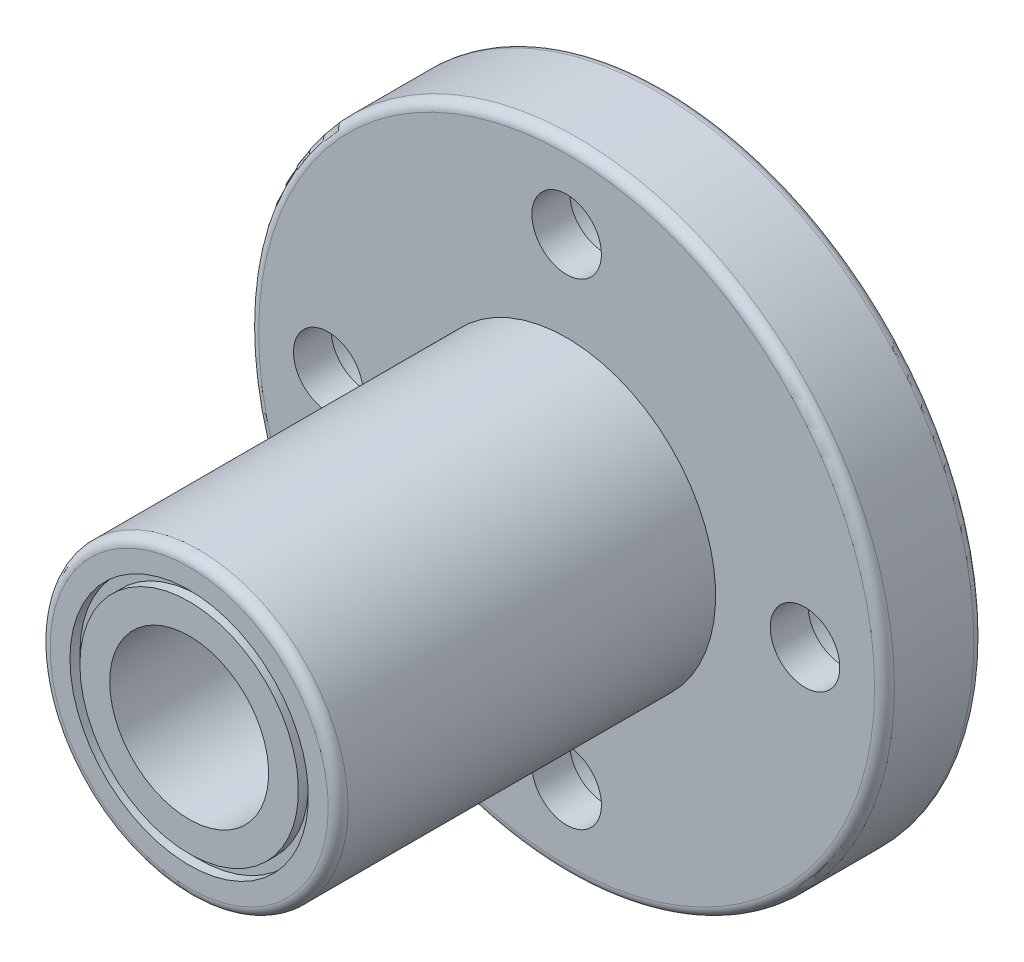
ISO-10303-21;
HEADER;
FILE_DESCRIPTION(('STEP AP214'),'2;1');
FILE_NAME('part.step','',(''),(''),'','','');
FILE_SCHEMA(('AUTOMOTIVE_DESIGN { 1 0 10303 214 1 1 1 1 }'));
ENDSEC;
DATA;
#1=APPLICATION_CONTEXT('core data for automotive mechanical design processes');
#2=APPLICATION_PROTOCOL_DEFINITION('international standard','automotive_design',2000,#1);
#3=PRODUCT_CONTEXT('',#1,'mechanical');
#4=PRODUCT('Part','Part','',(#3));
#5=PRODUCT_RELATED_PRODUCT_CATEGORY('part','',(#4));
#6=PRODUCT_DEFINITION_FORMATION('','',#4);
#7=PRODUCT_DEFINITION_CONTEXT('part definition',#1,'design');
#8=PRODUCT_DEFINITION('design','',#6,#7);
#9=PRODUCT_DEFINITION_SHAPE('','',#8);
#10=(LENGTH_UNIT() NAMED_UNIT(*) SI_UNIT(.MILLI.,.METRE.));
#11=(NAMED_UNIT(*) PLANE_ANGLE_UNIT() SI_UNIT($,.RADIAN.));
#12=(NAMED_UNIT(*) SI_UNIT($,.STERADIAN.) SOLID_ANGLE_UNIT());
#13=UNCERTAINTY_MEASURE_WITH_UNIT(LENGTH_MEASURE(1.E-05),#10,'distance_accuracy_value','');
#14=(GEOMETRIC_REPRESENTATION_CONTEXT(3) GLOBAL_UNCERTAINTY_ASSIGNED_CONTEXT((#13)) GLOBAL_UNIT_ASSIGNED_CONTEXT((#10,
#11,#12)) REPRESENTATION_CONTEXT('',''));
#15=CARTESIAN_POINT('',(0.,0.,0.));
#16=DIRECTION('',(0.,0.,1.));
#17=DIRECTION('',(1.,0.,0.));
#18=AXIS2_PLACEMENT_3D('',#15,#16,#17);
#19=CARTESIAN_POINT('',(0.,7.5,0.));
#20=DIRECTION('',(0.,0.,-1.));
#21=DIRECTION('',(-1.,0.,0.));
#22=AXIS2_PLACEMENT_3D('',#19,#20,#21);
#23=PLANE('',#22);
#24=CARTESIAN_POINT('',(0.,0.,0.));
#25=DIRECTION('',(0.,0.,-1.));
#26=DIRECTION('',(-1.,0.,0.));
#27=AXIS2_PLACEMENT_3D('',#24,#25,#26);
#28=CIRCLE('',#27,15.5);
#29=CARTESIAN_POINT('',(-15.5,0.,0.));
#30=VERTEX_POINT('',#29);
#31=EDGE_CURVE('E69',#30,#30,#28,.T.);
#32=ORIENTED_EDGE('',*,*,#31,.T.);
#33=EDGE_LOOP('',(#32));
#34=FACE_BOUND('',#33,.T.);
#35=CARTESIAN_POINT('',(0.,-12.,0.));
#36=DIRECTION('',(0.,0.,1.));
#37=DIRECTION('',(0.,1.,0.));
#38=AXIS2_PLACEMENT_3D('',#35,#36,#37);
#39=CIRCLE('',#38,3.);
#40=CARTESIAN_POINT('',(0.,-9.00000000000001,0.));
#41=VERTEX_POINT('',#40);
#42=EDGE_CURVE('E164',#41,#41,#39,.T.);
#43=ORIENTED_EDGE('',*,*,#42,.T.);
#44=EDGE_LOOP('',(#43));
#45=FACE_BOUND('',#44,.T.);
#46=CARTESIAN_POINT('',(0.,12.,0.));
#47=DIRECTION('',(0.,0.,1.));
#48=DIRECTION('',(0.,-1.,0.));
#49=AXIS2_PLACEMENT_3D('',#46,#47,#48);
#50=CIRCLE('',#49,3.);
#51=CARTESIAN_POINT('',(0.,9.00000000000001,0.));
#52=VERTEX_POINT('',#51);
#53=EDGE_CURVE('E133',#52,#52,#50,.T.);
#54=ORIENTED_EDGE('',*,*,#53,.T.);
#55=EDGE_LOOP('',(#54));
#56=FACE_BOUND('',#55,.T.);
#57=CARTESIAN_POINT('',(0.,0.,0.));
#58=DIRECTION('',(0.,0.,-1.));
#59=DIRECTION('',(-1.,0.,0.));
#60=AXIS2_PLACEMENT_3D('',#57,#58,#59);
#61=CIRCLE('',#60,7.5);
#62=CARTESIAN_POINT('',(-7.5,0.,0.));
#63=VERTEX_POINT('',#62);
#64=EDGE_CURVE('E129',#63,#63,#61,.T.);
#65=ORIENTED_EDGE('',*,*,#64,.F.);
#66=EDGE_LOOP('',(#65));
#67=FACE_BOUND('',#66,.T.);
#68=CARTESIAN_POINT('',(12.,0.,0.));
#69=DIRECTION('',(0.,0.,1.));
#70=DIRECTION('',(-1.,0.,0.));
#71=AXIS2_PLACEMENT_3D('',#68,#69,#70);
#72=CIRCLE('',#71,3.);
#73=CARTESIAN_POINT('',(9.00000000000001,0.,0.));
#74=VERTEX_POINT('',#73);
#75=EDGE_CURVE('E149',#74,#74,#72,.T.);
#76=ORIENTED_EDGE('',*,*,#75,.T.);
#77=EDGE_LOOP('',(#76));
#78=FACE_BOUND('',#77,.T.);
#79=CARTESIAN_POINT('',(-12.,1.25693328198353E-13,0.));
#80=DIRECTION('',(0.,0.,1.));
#81=DIRECTION('',(1.,0.,0.));
#82=AXIS2_PLACEMENT_3D('',#79,#80,#81);
#83=CIRCLE('',#82,3.);
#84=CARTESIAN_POINT('',(-9.00000000000001,0.,0.));
#85=VERTEX_POINT('',#84);
#86=EDGE_CURVE('E180',#85,#85,#83,.T.);
#87=ORIENTED_EDGE('',*,*,#86,.T.);
#88=EDGE_LOOP('',(#87));
#89=FACE_BOUND('',#88,.T.);
#90=ADVANCED_FACE('F40',(#34,#45,#56,#67,#78,#89),#23,.T.);
#91=CARTESIAN_POINT('',(0.,16.,5.));
#92=DIRECTION('',(0.,0.,1.));
#93=DIRECTION('',(1.,0.,0.));
#94=AXIS2_PLACEMENT_3D('',#91,#92,#93);
#95=PLANE('',#94);
#96=CARTESIAN_POINT('',(0.,0.,5.));
#97=DIRECTION('',(0.,0.,1.));
#98=DIRECTION('',(1.,0.,0.));
#99=AXIS2_PLACEMENT_3D('',#96,#97,#98);
#100=CIRCLE('',#99,15.5);
#101=CARTESIAN_POINT('',(15.5,0.,5.));
#102=VERTEX_POINT('',#101);
#103=EDGE_CURVE('E54',#102,#102,#100,.T.);
#104=ORIENTED_EDGE('',*,*,#103,.T.);
#105=EDGE_LOOP('',(#104));
#106=FACE_BOUND('',#105,.T.);
#107=CARTESIAN_POINT('',(0.,-12.,5.));
#108=DIRECTION('',(0.,0.,1.));
#109=DIRECTION('',(0.,1.,0.));
#110=AXIS2_PLACEMENT_3D('',#107,#108,#109);
#111=CIRCLE('',#110,1.75);
#112=CARTESIAN_POINT('',(0.,-10.25,5.));
#113=VERTEX_POINT('',#112);
#114=EDGE_CURVE('E176',#113,#113,#111,.T.);
#115=ORIENTED_EDGE('',*,*,#114,.F.);
#116=EDGE_LOOP('',(#115));
#117=FACE_BOUND('',#116,.T.);
#118=CARTESIAN_POINT('',(0.,12.,5.));
#119=DIRECTION('',(0.,0.,1.));
#120=DIRECTION('',(0.,-1.,0.));
#121=AXIS2_PLACEMENT_3D('',#118,#119,#120);
#122=CIRCLE('',#121,1.75);
#123=CARTESIAN_POINT('',(0.,10.25,5.));
#124=VERTEX_POINT('',#123);
#125=EDGE_CURVE('E145',#124,#124,#122,.T.);
#126=ORIENTED_EDGE('',*,*,#125,.F.);
#127=EDGE_LOOP('',(#126));
#128=FACE_BOUND('',#127,.T.);
#129=CARTESIAN_POINT('',(0.,0.,5.));
#130=DIRECTION('',(0.,0.,-1.));
#131=DIRECTION('',(-1.,0.,0.));
#132=AXIS2_PLACEMENT_3D('',#129,#130,#131);
#133=CIRCLE('',#132,7.5);
#134=CARTESIAN_POINT('',(-7.5,0.,5.));
#135=VERTEX_POINT('',#134);
#136=EDGE_CURVE('E73',#135,#135,#133,.T.);
#137=ORIENTED_EDGE('',*,*,#136,.T.);
#138=EDGE_LOOP('',(#137));
#139=FACE_BOUND('',#138,.T.);
#140=CARTESIAN_POINT('',(12.,0.,5.));
#141=DIRECTION('',(0.,0.,1.));
#142=DIRECTION('',(-1.,0.,0.));
#143=AXIS2_PLACEMENT_3D('',#140,#141,#142);
#144=CIRCLE('',#143,1.75);
#145=CARTESIAN_POINT('',(10.25,0.,5.));
#146=VERTEX_POINT('',#145);
#147=EDGE_CURVE('E161',#146,#146,#144,.T.);
#148=ORIENTED_EDGE('',*,*,#147,.F.);
#149=EDGE_LOOP('',(#148));
#150=FACE_BOUND('',#149,.T.);
#151=CARTESIAN_POINT('',(-12.,1.25693328198353E-13,5.));
#152=DIRECTION('',(0.,0.,1.));
#153=DIRECTION('',(1.,0.,0.));
#154=AXIS2_PLACEMENT_3D('',#151,#152,#153);
#155=CIRCLE('',#154,1.75);
#156=CARTESIAN_POINT('',(-10.25,1.07363051169426E-13,5.));
#157=VERTEX_POINT('',#156);
#158=EDGE_CURVE('E192',#157,#157,#155,.T.);
#159=ORIENTED_EDGE('',*,*,#158,.F.);
#160=EDGE_LOOP('',(#159));
#161=FACE_BOUND('',#160,.T.);
#162=ADVANCED_FACE('F200',(#106,#117,#128,#139,#150,#161),#95,.T.);
#163=CARTESIAN_POINT('',(0.,0.,0.));
#164=DIRECTION('',(0.,0.,-1.));
#165=DIRECTION('',(-1.,0.,0.));
#166=AXIS2_PLACEMENT_3D('',#163,#164,#165);
#167=CYLINDRICAL_SURFACE('',#166,16.);
#168=CARTESIAN_POINT('',(0.,0.,0.5));
#169=DIRECTION('',(0.,0.,-1.));
#170=DIRECTION('',(-1.,0.,0.));
#171=AXIS2_PLACEMENT_3D('',#168,#169,#170);
#172=CIRCLE('',#171,16.);
#173=CARTESIAN_POINT('',(-16.,0.,0.5));
#174=VERTEX_POINT('',#173);
#175=EDGE_CURVE('E60',#174,#174,#172,.F.);
#176=ORIENTED_EDGE('',*,*,#175,.T.);
#177=EDGE_LOOP('',(#176));
#178=FACE_BOUND('',#177,.T.);
#179=CARTESIAN_POINT('',(0.,0.,4.5));
#180=DIRECTION('',(0.,0.,1.));
#181=DIRECTION('',(1.,0.,0.));
#182=AXIS2_PLACEMENT_3D('',#179,#180,#181);
#183=CIRCLE('',#182,16.);
#184=CARTESIAN_POINT('',(16.,0.,4.5));
#185=VERTEX_POINT('',#184);
#186=EDGE_CURVE('E66',#185,#185,#183,.F.);
#187=ORIENTED_EDGE('',*,*,#186,.T.);
#188=EDGE_LOOP('',(#187));
#189=FACE_BOUND('',#188,.T.);
#190=ADVANCED_FACE('F202',(#178,#189),#167,.T.);
#191=CARTESIAN_POINT('',(0.,0.,0.));
#192=DIRECTION('',(0.,0.,-1.));
#193=DIRECTION('',(-1.,0.,0.));
#194=AXIS2_PLACEMENT_3D('',#191,#192,#193);
#195=CYLINDRICAL_SURFACE('',#194,7.5);
#196=CARTESIAN_POINT('',(0.,0.,23.5));
#197=DIRECTION('',(0.,0.,1.));
#198=DIRECTION('',(1.,0.,0.));
#199=AXIS2_PLACEMENT_3D('',#196,#197,#198);
#200=CIRCLE('',#199,7.5);
#201=CARTESIAN_POINT('',(7.5,0.,23.5));
#202=VERTEX_POINT('',#201);
#203=EDGE_CURVE('E48',#202,#202,#200,.F.);
#204=ORIENTED_EDGE('',*,*,#203,.T.);
#205=EDGE_LOOP('',(#204));
#206=FACE_BOUND('',#205,.T.);
#207=ORIENTED_EDGE('',*,*,#136,.F.);
#208=EDGE_LOOP('',(#207));
#209=FACE_BOUND('',#208,.T.);
#210=ADVANCED_FACE('F209',(#206,#209),#195,.T.);
#211=CARTESIAN_POINT('',(0.,7.5,24.));
#212=DIRECTION('',(0.,0.,1.));
#213=DIRECTION('',(1.,0.,0.));
#214=AXIS2_PLACEMENT_3D('',#211,#212,#213);
#215=PLANE('',#214);
#216=CARTESIAN_POINT('',(0.,0.,24.));
#217=DIRECTION('',(0.,0.,1.));
#218=DIRECTION('',(1.,0.,0.));
#219=AXIS2_PLACEMENT_3D('',#216,#217,#218);
#220=CIRCLE('',#219,7.);
#221=CARTESIAN_POINT('',(7.,0.,24.));
#222=VERTEX_POINT('',#221);
#223=EDGE_CURVE('E10',#222,#222,#220,.T.);
#224=ORIENTED_EDGE('',*,*,#223,.T.);
#225=EDGE_LOOP('',(#224));
#226=FACE_BOUND('',#225,.T.);
#227=CARTESIAN_POINT('',(0.,0.,24.));
#228=DIRECTION('',(0.,0.,-1.));
#229=DIRECTION('',(-1.,0.,0.));
#230=AXIS2_PLACEMENT_3D('',#227,#228,#229);
#231=CIRCLE('',#230,6.);
#232=CARTESIAN_POINT('',(-6.,0.,24.));
#233=VERTEX_POINT('',#232);
#234=EDGE_CURVE('E77',#233,#233,#231,.T.);
#235=ORIENTED_EDGE('',*,*,#234,.T.);
#236=EDGE_LOOP('',(#235));
#237=FACE_BOUND('',#236,.T.);
#238=ADVANCED_FACE('F466',(#226,#237),#215,.T.);
#239=CARTESIAN_POINT('',(0.,0.,0.));
#240=DIRECTION('',(0.,0.,-1.));
#241=DIRECTION('',(-1.,0.,0.));
#242=AXIS2_PLACEMENT_3D('',#239,#240,#241);
#243=CYLINDRICAL_SURFACE('',#242,6.);
#244=CARTESIAN_POINT('',(0.,0.,23.5));
#245=DIRECTION('',(0.,0.,-1.));
#246=DIRECTION('',(-1.,0.,0.));
#247=AXIS2_PLACEMENT_3D('',#244,#245,#246);
#248=CIRCLE('',#247,6.);
#249=CARTESIAN_POINT('',(-6.,0.,23.5));
#250=VERTEX_POINT('',#249);
#251=EDGE_CURVE('E81',#250,#250,#248,.T.);
#252=ORIENTED_EDGE('',*,*,#251,.T.);
#253=EDGE_LOOP('',(#252));
#254=FACE_BOUND('',#253,.T.);
#255=ORIENTED_EDGE('',*,*,#234,.F.);
#256=EDGE_LOOP('',(#255));
#257=FACE_BOUND('',#256,.T.);
#258=ADVANCED_FACE('F457',(#254,#257),#243,.F.);
#259=CARTESIAN_POINT('',(0.,6.,23.5));
#260=DIRECTION('',(0.,0.,1.));
#261=DIRECTION('',(1.,0.,0.));
#262=AXIS2_PLACEMENT_3D('',#259,#260,#261);
#263=PLANE('',#262);
#264=CARTESIAN_POINT('',(0.,0.,23.5));
#265=DIRECTION('',(0.,0.,-1.));
#266=DIRECTION('',(-1.,0.,0.));
#267=AXIS2_PLACEMENT_3D('',#264,#265,#266);
#268=CIRCLE('',#267,5.5);
#269=CARTESIAN_POINT('',(-5.5,0.,23.5));
#270=VERTEX_POINT('',#269);
#271=EDGE_CURVE('E85',#270,#270,#268,.T.);
#272=ORIENTED_EDGE('',*,*,#271,.T.);
#273=EDGE_LOOP('',(#272));
#274=FACE_BOUND('',#273,.T.);
#275=ORIENTED_EDGE('',*,*,#251,.F.);
#276=EDGE_LOOP('',(#275));
#277=FACE_BOUND('',#276,.T.);
#278=ADVANCED_FACE('F448',(#274,#277),#263,.T.);
#279=CARTESIAN_POINT('',(0.,0.,0.));
#280=DIRECTION('',(0.,0.,-1.));
#281=DIRECTION('',(-1.,0.,0.));
#282=AXIS2_PLACEMENT_3D('',#279,#280,#281);
#283=CYLINDRICAL_SURFACE('',#282,5.5);
#284=CARTESIAN_POINT('',(0.,0.,24.));
#285=DIRECTION('',(0.,0.,-1.));
#286=DIRECTION('',(-1.,0.,0.));
#287=AXIS2_PLACEMENT_3D('',#284,#285,#286);
#288=CIRCLE('',#287,5.5);
#289=CARTESIAN_POINT('',(-5.5,0.,24.));
#290=VERTEX_POINT('',#289);
#291=EDGE_CURVE('E89',#290,#290,#288,.T.);
#292=ORIENTED_EDGE('',*,*,#291,.T.);
#293=EDGE_LOOP('',(#292));
#294=FACE_BOUND('',#293,.T.);
#295=ORIENTED_EDGE('',*,*,#271,.F.);
#296=EDGE_LOOP('',(#295));
#297=FACE_BOUND('',#296,.T.);
#298=ADVANCED_FACE('F440',(#294,#297),#283,.T.);
#299=CARTESIAN_POINT('',(0.,5.5,24.));
#300=DIRECTION('',(0.,0.,1.));
#301=DIRECTION('',(1.,0.,0.));
#302=AXIS2_PLACEMENT_3D('',#299,#300,#301);
#303=PLANE('',#302);
#304=CARTESIAN_POINT('',(0.,0.,24.));
#305=DIRECTION('',(0.,0.,-1.));
#306=DIRECTION('',(-1.,0.,0.));
#307=AXIS2_PLACEMENT_3D('',#304,#305,#306);
#308=CIRCLE('',#307,4.);
#309=CARTESIAN_POINT('',(-4.,0.,24.));
#310=VERTEX_POINT('',#309);
#311=EDGE_CURVE('E93',#310,#310,#308,.T.);
#312=ORIENTED_EDGE('',*,*,#311,.T.);
#313=EDGE_LOOP('',(#312));
#314=FACE_BOUND('',#313,.T.);
#315=ORIENTED_EDGE('',*,*,#291,.F.);
#316=EDGE_LOOP('',(#315));
#317=FACE_BOUND('',#316,.T.);
#318=ADVANCED_FACE('F432',(#314,#317),#303,.T.);
#319=CARTESIAN_POINT('',(0.,0.,0.));
#320=DIRECTION('',(0.,0.,-1.));
#321=DIRECTION('',(-1.,0.,0.));
#322=AXIS2_PLACEMENT_3D('',#319,#320,#321);
#323=CYLINDRICAL_SURFACE('',#322,4.);
#324=CARTESIAN_POINT('',(0.,0.,0.));
#325=DIRECTION('',(0.,0.,-1.));
#326=DIRECTION('',(-1.,0.,0.));
#327=AXIS2_PLACEMENT_3D('',#324,#325,#326);
#328=CIRCLE('',#327,4.);
#329=CARTESIAN_POINT('',(-4.,0.,0.));
#330=VERTEX_POINT('',#329);
#331=EDGE_CURVE('E97',#330,#330,#328,.T.);
#332=ORIENTED_EDGE('',*,*,#331,.T.);
#333=EDGE_LOOP('',(#332));
#334=FACE_BOUND('',#333,.T.);
#335=ORIENTED_EDGE('',*,*,#311,.F.);
#336=EDGE_LOOP('',(#335));
#337=FACE_BOUND('',#336,.T.);
#338=ADVANCED_FACE('F423',(#334,#337),#323,.F.);
#339=CARTESIAN_POINT('',(0.,4.,0.));
#340=DIRECTION('',(0.,0.,-1.));
#341=DIRECTION('',(-1.,0.,0.));
#342=AXIS2_PLACEMENT_3D('',#339,#340,#341);
#343=PLANE('',#342);
#344=CARTESIAN_POINT('',(0.,0.,0.));
#345=DIRECTION('',(0.,0.,-1.));
#346=DIRECTION('',(-1.,0.,0.));
#347=AXIS2_PLACEMENT_3D('',#344,#345,#346);
#348=CIRCLE('',#347,5.5);
#349=CARTESIAN_POINT('',(-5.5,0.,0.));
#350=VERTEX_POINT('',#349);
#351=EDGE_CURVE('E101',#350,#350,#348,.T.);
#352=ORIENTED_EDGE('',*,*,#351,.T.);
#353=EDGE_LOOP('',(#352));
#354=FACE_BOUND('',#353,.T.);
#355=ORIENTED_EDGE('',*,*,#331,.F.);
#356=EDGE_LOOP('',(#355));
#357=FACE_BOUND('',#356,.T.);
#358=ADVANCED_FACE('F414',(#354,#357),#343,.T.);
#359=CARTESIAN_POINT('',(0.,0.,0.));
#360=DIRECTION('',(0.,0.,-1.));
#361=DIRECTION('',(-1.,0.,0.));
#362=AXIS2_PLACEMENT_3D('',#359,#360,#361);
#363=CYLINDRICAL_SURFACE('',#362,5.5);
#364=CARTESIAN_POINT('',(0.,0.,0.5));
#365=DIRECTION('',(0.,0.,-1.));
#366=DIRECTION('',(-1.,0.,0.));
#367=AXIS2_PLACEMENT_3D('',#364,#365,#366);
#368=CIRCLE('',#367,5.5);
#369=CARTESIAN_POINT('',(-5.5,0.,0.5));
#370=VERTEX_POINT('',#369);
#371=EDGE_CURVE('E105',#370,#370,#368,.T.);
#372=ORIENTED_EDGE('',*,*,#371,.T.);
#373=EDGE_LOOP('',(#372));
#374=FACE_BOUND('',#373,.T.);
#375=ORIENTED_EDGE('',*,*,#351,.F.);
#376=EDGE_LOOP('',(#375));
#377=FACE_BOUND('',#376,.T.);
#378=ADVANCED_FACE('F405',(#374,#377),#363,.T.);
#379=CARTESIAN_POINT('',(0.,6.,0.5));
#380=DIRECTION('',(0.,0.,-1.));
#381=DIRECTION('',(-1.,0.,0.));
#382=AXIS2_PLACEMENT_3D('',#379,#380,#381);
#383=PLANE('',#382);
#384=CARTESIAN_POINT('',(0.,0.,0.5));
#385=DIRECTION('',(0.,0.,-1.));
#386=DIRECTION('',(-1.,0.,0.));
#387=AXIS2_PLACEMENT_3D('',#384,#385,#386);
#388=CIRCLE('',#387,6.);
#389=CARTESIAN_POINT('',(-6.,0.,0.5));
#390=VERTEX_POINT('',#389);
#391=EDGE_CURVE('E109',#390,#390,#388,.T.);
#392=ORIENTED_EDGE('',*,*,#391,.T.);
#393=EDGE_LOOP('',(#392));
#394=FACE_BOUND('',#393,.T.);
#395=ORIENTED_EDGE('',*,*,#371,.F.);
#396=EDGE_LOOP('',(#395));
#397=FACE_BOUND('',#396,.T.);
#398=ADVANCED_FACE('F396',(#394,#397),#383,.T.);
#399=CARTESIAN_POINT('',(0.,0.,0.));
#400=DIRECTION('',(0.,0.,-1.));
#401=DIRECTION('',(-1.,0.,0.));
#402=AXIS2_PLACEMENT_3D('',#399,#400,#401);
#403=CYLINDRICAL_SURFACE('',#402,6.);
#404=CARTESIAN_POINT('',(0.,0.,0.));
#405=DIRECTION('',(0.,0.,-1.));
#406=DIRECTION('',(-1.,0.,0.));
#407=AXIS2_PLACEMENT_3D('',#404,#405,#406);
#408=CIRCLE('',#407,6.);
#409=CARTESIAN_POINT('',(-6.,0.,0.));
#410=VERTEX_POINT('',#409);
#411=EDGE_CURVE('E113',#410,#410,#408,.T.);
#412=ORIENTED_EDGE('',*,*,#411,.T.);
#413=EDGE_LOOP('',(#412));
#414=FACE_BOUND('',#413,.T.);
#415=ORIENTED_EDGE('',*,*,#391,.F.);
#416=EDGE_LOOP('',(#415));
#417=FACE_BOUND('',#416,.T.);
#418=ADVANCED_FACE('F387',(#414,#417),#403,.F.);
#419=CARTESIAN_POINT('',(0.,6.,0.));
#420=DIRECTION('',(0.,0.,-1.));
#421=DIRECTION('',(-1.,0.,0.));
#422=AXIS2_PLACEMENT_3D('',#419,#420,#421);
#423=PLANE('',#422);
#424=CARTESIAN_POINT('',(0.,0.,0.));
#425=DIRECTION('',(0.,0.,-1.));
#426=DIRECTION('',(-1.,0.,0.));
#427=AXIS2_PLACEMENT_3D('',#424,#425,#426);
#428=CIRCLE('',#427,7.);
#429=CARTESIAN_POINT('',(-7.,0.,0.));
#430=VERTEX_POINT('',#429);
#431=EDGE_CURVE('E117',#430,#430,#428,.T.);
#432=ORIENTED_EDGE('',*,*,#431,.T.);
#433=EDGE_LOOP('',(#432));
#434=FACE_BOUND('',#433,.T.);
#435=ORIENTED_EDGE('',*,*,#411,.F.);
#436=EDGE_LOOP('',(#435));
#437=FACE_BOUND('',#436,.T.);
#438=ADVANCED_FACE('F378',(#434,#437),#423,.T.);
#439=CARTESIAN_POINT('',(0.,0.,0.));
#440=DIRECTION('',(0.,0.,-1.));
#441=DIRECTION('',(-1.,0.,0.));
#442=AXIS2_PLACEMENT_3D('',#439,#440,#441);
#443=CYLINDRICAL_SURFACE('',#442,7.);
#444=CARTESIAN_POINT('',(0.,0.,0.500000000000001));
#445=DIRECTION('',(0.,0.,-1.));
#446=DIRECTION('',(-1.,0.,0.));
#447=AXIS2_PLACEMENT_3D('',#444,#445,#446);
#448=CIRCLE('',#447,7.);
#449=CARTESIAN_POINT('',(-7.,0.,0.500000000000001));
#450=VERTEX_POINT('',#449);
#451=EDGE_CURVE('E121',#450,#450,#448,.T.);
#452=ORIENTED_EDGE('',*,*,#451,.T.);
#453=EDGE_LOOP('',(#452));
#454=FACE_BOUND('',#453,.T.);
#455=ORIENTED_EDGE('',*,*,#431,.F.);
#456=EDGE_LOOP('',(#455));
#457=FACE_BOUND('',#456,.T.);
#458=ADVANCED_FACE('F369',(#454,#457),#443,.T.);
#459=CARTESIAN_POINT('',(0.,7.5,0.5));
#460=DIRECTION('',(0.,0.,-1.));
#461=DIRECTION('',(-1.,0.,0.));
#462=AXIS2_PLACEMENT_3D('',#459,#460,#461);
#463=PLANE('',#462);
#464=CARTESIAN_POINT('',(0.,0.,0.5));
#465=DIRECTION('',(0.,0.,-1.));
#466=DIRECTION('',(-1.,0.,0.));
#467=AXIS2_PLACEMENT_3D('',#464,#465,#466);
#468=CIRCLE('',#467,7.5);
#469=CARTESIAN_POINT('',(-7.5,0.,0.5));
#470=VERTEX_POINT('',#469);
#471=EDGE_CURVE('E125',#470,#470,#468,.T.);
#472=ORIENTED_EDGE('',*,*,#471,.T.);
#473=EDGE_LOOP('',(#472));
#474=FACE_BOUND('',#473,.T.);
#475=ORIENTED_EDGE('',*,*,#451,.F.);
#476=EDGE_LOOP('',(#475));
#477=FACE_BOUND('',#476,.T.);
#478=ADVANCED_FACE('F360',(#474,#477),#463,.T.);
#479=CARTESIAN_POINT('',(0.,0.,0.));
#480=DIRECTION('',(0.,0.,-1.));
#481=DIRECTION('',(-1.,0.,0.));
#482=AXIS2_PLACEMENT_3D('',#479,#480,#481);
#483=CYLINDRICAL_SURFACE('',#482,7.5);
#484=ORIENTED_EDGE('',*,*,#64,.T.);
#485=EDGE_LOOP('',(#484));
#486=FACE_BOUND('',#485,.T.);
#487=ORIENTED_EDGE('',*,*,#471,.F.);
#488=EDGE_LOOP('',(#487));
#489=FACE_BOUND('',#488,.T.);
#490=ADVANCED_FACE('F351',(#486,#489),#483,.F.);
#491=CARTESIAN_POINT('',(0.,12.,0.));
#492=DIRECTION('',(0.,0.,1.));
#493=DIRECTION('',(0.,-1.,0.));
#494=AXIS2_PLACEMENT_3D('',#491,#492,#493);
#495=CYLINDRICAL_SURFACE('',#494,3.);
#496=CARTESIAN_POINT('',(0.,12.,3.1));
#497=DIRECTION('',(0.,0.,1.));
#498=DIRECTION('',(0.,-1.,0.));
#499=AXIS2_PLACEMENT_3D('',#496,#497,#498);
#500=CIRCLE('',#499,2.99999999999999);
#501=CARTESIAN_POINT('',(0.,9.00000000000001,3.1));
#502=VERTEX_POINT('',#501);
#503=EDGE_CURVE('E137',#502,#502,#500,.T.);
#504=ORIENTED_EDGE('',*,*,#503,.T.);
#505=EDGE_LOOP('',(#504));
#506=FACE_BOUND('',#505,.T.);
#507=ORIENTED_EDGE('',*,*,#53,.F.);
#508=EDGE_LOOP('',(#507));
#509=FACE_BOUND('',#508,.T.);
#510=ADVANCED_FACE('F342',(#506,#509),#495,.F.);
#511=CARTESIAN_POINT('',(0.,15.,3.1));
#512=DIRECTION('',(0.,0.,-1.));
#513=DIRECTION('',(0.,1.,0.));
#514=AXIS2_PLACEMENT_3D('',#511,#512,#513);
#515=PLANE('',#514);
#516=CARTESIAN_POINT('',(0.,12.,3.1));
#517=DIRECTION('',(0.,0.,1.));
#518=DIRECTION('',(0.,-1.,0.));
#519=AXIS2_PLACEMENT_3D('',#516,#517,#518);
#520=CIRCLE('',#519,1.75);
#521=CARTESIAN_POINT('',(0.,10.25,3.1));
#522=VERTEX_POINT('',#521);
#523=EDGE_CURVE('E141',#522,#522,#520,.T.);
#524=ORIENTED_EDGE('',*,*,#523,.T.);
#525=EDGE_LOOP('',(#524));
#526=FACE_BOUND('',#525,.T.);
#527=ORIENTED_EDGE('',*,*,#503,.F.);
#528=EDGE_LOOP('',(#527));
#529=FACE_BOUND('',#528,.T.);
#530=ADVANCED_FACE('F333',(#526,#529),#515,.T.);
#531=CARTESIAN_POINT('',(0.,12.,0.));
#532=DIRECTION('',(0.,0.,1.));
#533=DIRECTION('',(0.,-1.,0.));
#534=AXIS2_PLACEMENT_3D('',#531,#532,#533);
#535=CYLINDRICAL_SURFACE('',#534,1.75);
#536=ORIENTED_EDGE('',*,*,#125,.T.);
#537=EDGE_LOOP('',(#536));
#538=FACE_BOUND('',#537,.T.);
#539=ORIENTED_EDGE('',*,*,#523,.F.);
#540=EDGE_LOOP('',(#539));
#541=FACE_BOUND('',#540,.T.);
#542=ADVANCED_FACE('F324',(#538,#541),#535,.F.);
#543=CARTESIAN_POINT('',(12.,0.,0.));
#544=DIRECTION('',(0.,0.,1.));
#545=DIRECTION('',(-1.,0.,0.));
#546=AXIS2_PLACEMENT_3D('',#543,#544,#545);
#547=CYLINDRICAL_SURFACE('',#546,3.);
#548=CARTESIAN_POINT('',(12.,0.,3.1));
#549=DIRECTION('',(0.,0.,1.));
#550=DIRECTION('',(-1.,0.,0.));
#551=AXIS2_PLACEMENT_3D('',#548,#549,#550);
#552=CIRCLE('',#551,2.99999999999999);
#553=CARTESIAN_POINT('',(9.00000000000001,0.,3.1));
#554=VERTEX_POINT('',#553);
#555=EDGE_CURVE('E153',#554,#554,#552,.T.);
#556=ORIENTED_EDGE('',*,*,#555,.T.);
#557=EDGE_LOOP('',(#556));
#558=FACE_BOUND('',#557,.T.);
#559=ORIENTED_EDGE('',*,*,#75,.F.);
#560=EDGE_LOOP('',(#559));
#561=FACE_BOUND('',#560,.T.);
#562=ADVANCED_FACE('F316',(#558,#561),#547,.F.);
#563=CARTESIAN_POINT('',(15.,0.,3.1));
#564=DIRECTION('',(0.,0.,-1.));
#565=DIRECTION('',(1.,0.,0.));
#566=AXIS2_PLACEMENT_3D('',#563,#564,#565);
#567=PLANE('',#566);
#568=CARTESIAN_POINT('',(12.,0.,3.1));
#569=DIRECTION('',(0.,0.,1.));
#570=DIRECTION('',(-1.,0.,0.));
#571=AXIS2_PLACEMENT_3D('',#568,#569,#570);
#572=CIRCLE('',#571,1.75);
#573=CARTESIAN_POINT('',(10.25,0.,3.1));
#574=VERTEX_POINT('',#573);
#575=EDGE_CURVE('E157',#574,#574,#572,.T.);
#576=ORIENTED_EDGE('',*,*,#575,.T.);
#577=EDGE_LOOP('',(#576));
#578=FACE_BOUND('',#577,.T.);
#579=ORIENTED_EDGE('',*,*,#555,.F.);
#580=EDGE_LOOP('',(#579));
#581=FACE_BOUND('',#580,.T.);
#582=ADVANCED_FACE('F308',(#578,#581),#567,.T.);
#583=CARTESIAN_POINT('',(12.,0.,0.));
#584=DIRECTION('',(0.,0.,1.));
#585=DIRECTION('',(-1.,0.,0.));
#586=AXIS2_PLACEMENT_3D('',#583,#584,#585);
#587=CYLINDRICAL_SURFACE('',#586,1.75);
#588=ORIENTED_EDGE('',*,*,#147,.T.);
#589=EDGE_LOOP('',(#588));
#590=FACE_BOUND('',#589,.T.);
#591=ORIENTED_EDGE('',*,*,#575,.F.);
#592=EDGE_LOOP('',(#591));
#593=FACE_BOUND('',#592,.T.);
#594=ADVANCED_FACE('F300',(#590,#593),#587,.F.);
#595=CARTESIAN_POINT('',(0.,-12.,0.));
#596=DIRECTION('',(0.,0.,1.));
#597=DIRECTION('',(0.,1.,0.));
#598=AXIS2_PLACEMENT_3D('',#595,#596,#597);
#599=CYLINDRICAL_SURFACE('',#598,3.);
#600=CARTESIAN_POINT('',(0.,-12.,3.1));
#601=DIRECTION('',(0.,0.,1.));
#602=DIRECTION('',(0.,1.,0.));
#603=AXIS2_PLACEMENT_3D('',#600,#601,#602);
#604=CIRCLE('',#603,2.99999999999999);
#605=CARTESIAN_POINT('',(0.,-9.00000000000001,3.1));
#606=VERTEX_POINT('',#605);
#607=EDGE_CURVE('E168',#606,#606,#604,.T.);
#608=ORIENTED_EDGE('',*,*,#607,.T.);
#609=EDGE_LOOP('',(#608));
#610=FACE_BOUND('',#609,.T.);
#611=ORIENTED_EDGE('',*,*,#42,.F.);
#612=EDGE_LOOP('',(#611));
#613=FACE_BOUND('',#612,.T.);
#614=ADVANCED_FACE('F292',(#610,#613),#599,.F.);
#615=CARTESIAN_POINT('',(0.,-15.,3.1));
#616=DIRECTION('',(0.,0.,-1.));
#617=DIRECTION('',(0.,-1.,0.));
#618=AXIS2_PLACEMENT_3D('',#615,#616,#617);
#619=PLANE('',#618);
#620=CARTESIAN_POINT('',(0.,-12.,3.1));
#621=DIRECTION('',(0.,0.,1.));
#622=DIRECTION('',(0.,1.,0.));
#623=AXIS2_PLACEMENT_3D('',#620,#621,#622);
#624=CIRCLE('',#623,1.75);
#625=CARTESIAN_POINT('',(0.,-10.25,3.1));
#626=VERTEX_POINT('',#625);
#627=EDGE_CURVE('E172',#626,#626,#624,.T.);
#628=ORIENTED_EDGE('',*,*,#627,.T.);
#629=EDGE_LOOP('',(#628));
#630=FACE_BOUND('',#629,.T.);
#631=ORIENTED_EDGE('',*,*,#607,.F.);
#632=EDGE_LOOP('',(#631));
#633=FACE_BOUND('',#632,.T.);
#634=ADVANCED_FACE('F283',(#630,#633),#619,.T.);
#635=CARTESIAN_POINT('',(0.,-12.,0.));
#636=DIRECTION('',(0.,0.,1.));
#637=DIRECTION('',(0.,1.,0.));
#638=AXIS2_PLACEMENT_3D('',#635,#636,#637);
#639=CYLINDRICAL_SURFACE('',#638,1.75);
#640=ORIENTED_EDGE('',*,*,#114,.T.);
#641=EDGE_LOOP('',(#640));
#642=FACE_BOUND('',#641,.T.);
#643=ORIENTED_EDGE('',*,*,#627,.F.);
#644=EDGE_LOOP('',(#643));
#645=FACE_BOUND('',#644,.T.);
#646=ADVANCED_FACE('F272',(#642,#645),#639,.F.);
#647=CARTESIAN_POINT('',(-12.,1.25693328198353E-13,0.));
#648=DIRECTION('',(0.,0.,1.));
#649=DIRECTION('',(1.,0.,0.));
#650=AXIS2_PLACEMENT_3D('',#647,#648,#649);
#651=CYLINDRICAL_SURFACE('',#650,3.);
#652=CARTESIAN_POINT('',(-12.,1.25693328198353E-13,3.1));
#653=DIRECTION('',(0.,0.,1.));
#654=DIRECTION('',(1.,0.,0.));
#655=AXIS2_PLACEMENT_3D('',#652,#653,#654);
#656=CIRCLE('',#655,2.99999999999999);
#657=CARTESIAN_POINT('',(-9.00000000000001,0.,3.1));
#658=VERTEX_POINT('',#657);
#659=EDGE_CURVE('E184',#658,#658,#656,.T.);
#660=ORIENTED_EDGE('',*,*,#659,.T.);
#661=EDGE_LOOP('',(#660));
#662=FACE_BOUND('',#661,.T.);
#663=ORIENTED_EDGE('',*,*,#86,.F.);
#664=EDGE_LOOP('',(#663));
#665=FACE_BOUND('',#664,.T.);
#666=ADVANCED_FACE('F261',(#662,#665),#651,.F.);
#667=CARTESIAN_POINT('',(-15.,1.57116660247941E-13,3.1));
#668=DIRECTION('',(0.,0.,-1.));
#669=DIRECTION('',(-1.,0.,0.));
#670=AXIS2_PLACEMENT_3D('',#667,#668,#669);
#671=PLANE('',#670);
#672=CARTESIAN_POINT('',(-12.,1.25693328198353E-13,3.1));
#673=DIRECTION('',(0.,0.,1.));
#674=DIRECTION('',(1.,0.,0.));
#675=AXIS2_PLACEMENT_3D('',#672,#673,#674);
#676=CIRCLE('',#675,1.75);
#677=CARTESIAN_POINT('',(-10.25,1.07363051169426E-13,3.1));
#678=VERTEX_POINT('',#677);
#679=EDGE_CURVE('E188',#678,#678,#676,.T.);
#680=ORIENTED_EDGE('',*,*,#679,.T.);
#681=EDGE_LOOP('',(#680));
#682=FACE_BOUND('',#681,.T.);
#683=ORIENTED_EDGE('',*,*,#659,.F.);
#684=EDGE_LOOP('',(#683));
#685=FACE_BOUND('',#684,.T.);
#686=ADVANCED_FACE('F251',(#682,#685),#671,.T.);
#687=CARTESIAN_POINT('',(-12.,1.25693328198353E-13,0.));
#688=DIRECTION('',(0.,0.,1.));
#689=DIRECTION('',(1.,0.,0.));
#690=AXIS2_PLACEMENT_3D('',#687,#688,#689);
#691=CYLINDRICAL_SURFACE('',#690,1.75);
#692=ORIENTED_EDGE('',*,*,#158,.T.);
#693=EDGE_LOOP('',(#692));
#694=FACE_BOUND('',#693,.T.);
#695=ORIENTED_EDGE('',*,*,#679,.F.);
#696=EDGE_LOOP('',(#695));
#697=FACE_BOUND('',#696,.T.);
#698=ADVANCED_FACE('F197',(#694,#697),#691,.F.);
#699=CARTESIAN_POINT('',(0.,0.,0.5));
#700=DIRECTION('',(0.,0.,-1.));
#701=DIRECTION('',(-1.,0.,0.));
#702=AXIS2_PLACEMENT_3D('',#699,#700,#701);
#703=TOROIDAL_SURFACE('',#702,15.5,0.5);
#704=ORIENTED_EDGE('',*,*,#175,.F.);
#705=EDGE_LOOP('',(#704));
#706=FACE_BOUND('',#705,.T.);
#707=ORIENTED_EDGE('',*,*,#31,.F.);
#708=EDGE_LOOP('',(#707));
#709=FACE_BOUND('',#708,.T.);
#710=ADVANCED_FACE('F218',(#706,#709),#703,.T.);
#711=CARTESIAN_POINT('',(0.,0.,4.5));
#712=DIRECTION('',(0.,0.,1.));
#713=DIRECTION('',(1.,0.,0.));
#714=AXIS2_PLACEMENT_3D('',#711,#712,#713);
#715=TOROIDAL_SURFACE('',#714,15.5,0.5);
#716=ORIENTED_EDGE('',*,*,#103,.F.);
#717=EDGE_LOOP('',(#716));
#718=FACE_BOUND('',#717,.T.);
#719=ORIENTED_EDGE('',*,*,#186,.F.);
#720=EDGE_LOOP('',(#719));
#721=FACE_BOUND('',#720,.T.);
#722=ADVANCED_FACE('F220',(#718,#721),#715,.T.);
#723=CARTESIAN_POINT('',(0.,0.,23.5));
#724=DIRECTION('',(0.,0.,1.));
#725=DIRECTION('',(1.,0.,0.));
#726=AXIS2_PLACEMENT_3D('',#723,#724,#725);
#727=TOROIDAL_SURFACE('',#726,7.,0.5);
#728=ORIENTED_EDGE('',*,*,#223,.F.);
#729=EDGE_LOOP('',(#728));
#730=FACE_BOUND('',#729,.T.);
#731=ORIENTED_EDGE('',*,*,#203,.F.);
#732=EDGE_LOOP('',(#731));
#733=FACE_BOUND('',#732,.T.);
#734=ADVANCED_FACE('F42',(#730,#733),#727,.T.);
#735=CLOSED_SHELL('',(#90,#162,#190,#210,#238,#258,#278,#298,#318,#338,#358,#378,#398,#418,#438,
#458,#478,#490,#510,#530,#542,#562,#582,#594,#614,#634,#646,#666,#686,#698,#710,#722,#734));
#736=MANIFOLD_SOLID_BREP('B2',#735);
#737=ADVANCED_BREP_SHAPE_REPRESENTATION('',(#18,#736),#14);
#738=SHAPE_DEFINITION_REPRESENTATION(#9,#737);
ENDSEC;
END-ISO-10303-21;
